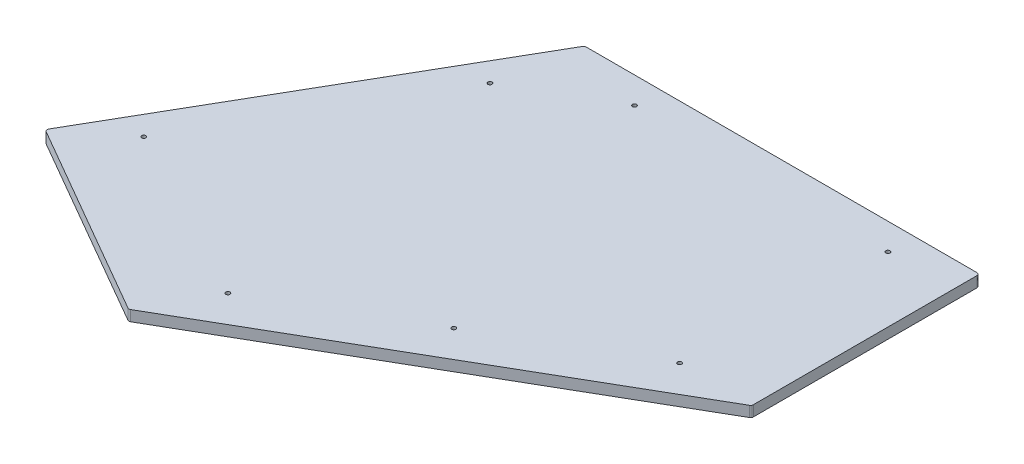
ISO-10303-21;
HEADER;
FILE_DESCRIPTION(('STEP AP214'),'2;1');
FILE_NAME('part.step','',(''),(''),'','','');
FILE_SCHEMA(('AUTOMOTIVE_DESIGN { 1 0 10303 214 1 1 1 1 }'));
ENDSEC;
DATA;
#1=APPLICATION_CONTEXT('core data for automotive mechanical design processes');
#2=APPLICATION_PROTOCOL_DEFINITION('international standard','automotive_design',2000,#1);
#3=PRODUCT_CONTEXT('',#1,'mechanical');
#4=PRODUCT('Part','Part','',(#3));
#5=PRODUCT_RELATED_PRODUCT_CATEGORY('part','',(#4));
#6=PRODUCT_DEFINITION_FORMATION('','',#4);
#7=PRODUCT_DEFINITION_CONTEXT('part definition',#1,'design');
#8=PRODUCT_DEFINITION('design','',#6,#7);
#9=PRODUCT_DEFINITION_SHAPE('','',#8);
#10=(LENGTH_UNIT() NAMED_UNIT(*) SI_UNIT(.MILLI.,.METRE.));
#11=(NAMED_UNIT(*) PLANE_ANGLE_UNIT() SI_UNIT($,.RADIAN.));
#12=(NAMED_UNIT(*) SI_UNIT($,.STERADIAN.) SOLID_ANGLE_UNIT());
#13=UNCERTAINTY_MEASURE_WITH_UNIT(LENGTH_MEASURE(1.E-05),#10,'distance_accuracy_value','');
#14=(GEOMETRIC_REPRESENTATION_CONTEXT(3) GLOBAL_UNCERTAINTY_ASSIGNED_CONTEXT((#13)) GLOBAL_UNIT_ASSIGNED_CONTEXT((#10,
#11,#12)) REPRESENTATION_CONTEXT('',''));
#15=CARTESIAN_POINT('',(0.,0.,0.));
#16=DIRECTION('',(0.,0.,1.));
#17=DIRECTION('',(1.,0.,0.));
#18=AXIS2_PLACEMENT_3D('',#15,#16,#17);
#19=CARTESIAN_POINT('',(0.,12.7,0.));
#20=DIRECTION('',(0.,1.,0.));
#21=DIRECTION('',(0.,0.,1.));
#22=AXIS2_PLACEMENT_3D('',#19,#20,#21);
#23=PLANE('',#22);
#24=CARTESIAN_POINT('',(213.713214706211,12.7,370.159699048508));
#25=DIRECTION('',(0.,1.,0.));
#26=DIRECTION('',(0.,0.,1.));
#27=AXIS2_PLACEMENT_3D('',#24,#25,#26);
#28=CIRCLE('',#27,2.45745000000002);
#29=CARTESIAN_POINT('',(213.713214706211,12.7,372.617149048508));
#30=VERTEX_POINT('',#29);
#31=EDGE_CURVE('E238',#30,#30,#28,.T.);
#32=ORIENTED_EDGE('',*,*,#31,.F.);
#33=EDGE_LOOP('',(#32));
#34=FACE_BOUND('',#33,.T.);
#35=CARTESIAN_POINT('',(394.287600704311,12.7,31.7496055682207));
#36=DIRECTION('',(0.,1.,0.));
#37=DIRECTION('',(0.,0.,1.));
#38=AXIS2_PLACEMENT_3D('',#35,#36,#37);
#39=CIRCLE('',#38,2.45744999999996);
#40=CARTESIAN_POINT('',(394.287600704311,12.7,34.2070555682207));
#41=VERTEX_POINT('',#40);
#42=EDGE_CURVE('E226',#41,#41,#39,.T.);
#43=ORIENTED_EDGE('',*,*,#42,.F.);
#44=EDGE_LOOP('',(#43));
#45=FACE_BOUND('',#44,.T.);
#46=CARTESIAN_POINT('',(-18.1641461086996,12.7,94.9617772273125));
#47=DIRECTION('',(0.,1.,0.));
#48=DIRECTION('',(0.,0.,1.));
#49=AXIS2_PLACEMENT_3D('',#46,#47,#48);
#50=CIRCLE('',#49,2.45744999999995);
#51=CARTESIAN_POINT('',(-18.1641461086996,12.7,97.4192272273125));
#52=VERTEX_POINT('',#51);
#53=EDGE_CURVE('E215',#52,#52,#50,.T.);
#54=ORIENTED_EDGE('',*,*,#53,.F.);
#55=EDGE_LOOP('',(#54));
#56=FACE_BOUND('',#55,.T.);
#57=DIRECTION('',(0.866023972491497,0.,-0.5000024790639));
#58=VECTOR('',#57,1.);
#59=CARTESIAN_POINT('',(-0.199185023168236,12.7,544.989420830469));
#60=LINE('',#59,#58);
#61=CARTESIAN_POINT('',(1.38831204742367,12.7,544.072872910301));
#62=VERTEX_POINT('',#61);
#63=CARTESIAN_POINT('',(470.487608575339,12.7,273.23647733536));
#64=VERTEX_POINT('',#63);
#65=EDGE_CURVE('E148',#62,#64,#60,.T.);
#66=ORIENTED_EDGE('',*,*,#65,.T.);
#67=CARTESIAN_POINT('',(468.900100704311,12.7,270.486851222699));
#68=DIRECTION('',(0.,1.,0.));
#69=DIRECTION('',(0.,0.,1.));
#70=AXIS2_PLACEMENT_3D('',#67,#68,#69);
#71=CIRCLE('',#70,3.175);
#72=CARTESIAN_POINT('',(472.075100704311,12.7,270.486851222699));
#73=VERTEX_POINT('',#72);
#74=EDGE_CURVE('E165',#64,#73,#71,.T.);
#75=ORIENTED_EDGE('',*,*,#74,.T.);
#76=DIRECTION('',(0.,0.,-1.));
#77=VECTOR('',#76,1.);
#78=CARTESIAN_POINT('',(472.075100704311,12.7,89.69375));
#79=LINE('',#78,#77);
#80=CARTESIAN_POINT('',(472.075100704311,12.7,3.175));
#81=VERTEX_POINT('',#80);
#82=EDGE_CURVE('E132',#73,#81,#79,.T.);
#83=ORIENTED_EDGE('',*,*,#82,.T.);
#84=CARTESIAN_POINT('',(468.900100704311,12.7,3.175));
#85=DIRECTION('',(0.,1.,0.));
#86=DIRECTION('',(0.,0.,1.));
#87=AXIS2_PLACEMENT_3D('',#84,#85,#86);
#88=CIRCLE('',#87,3.175);
#89=CARTESIAN_POINT('',(468.900100704311,12.7,0.));
#90=VERTEX_POINT('',#89);
#91=EDGE_CURVE('E159',#81,#90,#88,.T.);
#92=ORIENTED_EDGE('',*,*,#91,.T.);
#93=DIRECTION('',(-1.,0.,0.));
#94=VECTOR('',#93,1.);
#95=CARTESIAN_POINT('',(472.075100704311,12.7,0.));
#96=LINE('',#95,#94);
#97=CARTESIAN_POINT('',(1.83309351682742,12.7,0.));
#98=VERTEX_POINT('',#97);
#99=EDGE_CURVE('E142',#90,#98,#96,.T.);
#100=ORIENTED_EDGE('',*,*,#99,.T.);
#101=CARTESIAN_POINT('',(1.83309351682742,12.7,3.175));
#102=DIRECTION('',(0.,1.,0.));
#103=DIRECTION('',(0.,0.,1.));
#104=AXIS2_PLACEMENT_3D('',#101,#102,#103);
#105=CIRCLE('',#104,3.175);
#106=CARTESIAN_POINT('',(-0.916541949284118,12.7,1.58750832962766));
#107=VERTEX_POINT('',#106);
#108=EDGE_CURVE('E161',#98,#107,#105,.T.);
#109=ORIENTED_EDGE('',*,*,#108,.T.);
#110=DIRECTION('',(-0.499997376495225,0.,0.866026918460328));
#111=VECTOR('',#110,1.);
#112=CARTESIAN_POINT('',(0.,12.7,0.));
#113=LINE('',#112,#111);
#114=CARTESIAN_POINT('',(-234.448820190503,12.7,406.080109278692));
#115=VERTEX_POINT('',#114);
#116=EDGE_CURVE('E210',#107,#115,#113,.T.);
#117=ORIENTED_EDGE('',*,*,#116,.T.);
#118=CARTESIAN_POINT('',(-231.699184724391,12.7,407.667600949065));
#119=DIRECTION('',(0.,1.,0.));
#120=DIRECTION('',(0.,0.,1.));
#121=AXIS2_PLACEMENT_3D('',#118,#119,#120);
#122=CIRCLE('',#121,3.175);
#123=CARTESIAN_POINT('',(-233.286676394763,12.7,410.417236415176));
#124=VERTEX_POINT('',#123);
#125=EDGE_CURVE('E56',#115,#124,#122,.T.);
#126=ORIENTED_EDGE('',*,*,#125,.T.);
#127=DIRECTION('',(0.866026918460328,0.,0.499997376495225));
#128=VECTOR('',#127,1.);
#129=CARTESIAN_POINT('',(-236.036311860875,12.7,408.829744744804));
#130=LINE('',#129,#128);
#131=CARTESIAN_POINT('',(-1.78668749397667,12.7,544.072882263752));
#132=VERTEX_POINT('',#131);
#133=EDGE_CURVE('E207',#124,#132,#130,.T.);
#134=ORIENTED_EDGE('',*,*,#133,.T.);
#135=CARTESIAN_POINT('',(-0.199195823604249,12.7,541.323246797641));
#136=DIRECTION('',(0.,1.,0.));
#137=DIRECTION('',(0.,0.,1.));
#138=AXIS2_PLACEMENT_3D('',#135,#136,#137);
#139=CIRCLE('',#138,3.175);
#140=EDGE_CURVE('E163',#132,#62,#139,.T.);
#141=ORIENTED_EDGE('',*,*,#140,.T.);
#142=EDGE_LOOP('',(#66,#75,#83,#92,#100,#109,#117,#126,#134,#141));
#143=FACE_BOUND('',#142,.T.);
#144=CARTESIAN_POINT('',(-169.646411275637,12.7,357.338592528794));
#145=DIRECTION('',(0.,1.,0.));
#146=DIRECTION('',(0.,0.,1.));
#147=AXIS2_PLACEMENT_3D('',#144,#145,#146);
#148=CIRCLE('',#147,2.45744999999998);
#149=CARTESIAN_POINT('',(-169.646411275637,12.7,359.796042528794));
#150=VERTEX_POINT('',#149);
#151=EDGE_CURVE('E188',#150,#150,#148,.T.);
#152=ORIENTED_EDGE('',*,*,#151,.F.);
#153=EDGE_LOOP('',(#152));
#154=FACE_BOUND('',#153,.T.);
#155=CARTESIAN_POINT('',(91.3214807043114,12.7,31.7496055682207));
#156=DIRECTION('',(0.,1.,0.));
#157=DIRECTION('',(0.,0.,1.));
#158=AXIS2_PLACEMENT_3D('',#155,#156,#157);
#159=CIRCLE('',#158,2.45744999999997);
#160=CARTESIAN_POINT('',(91.3214807043114,12.7,34.2070555682207));
#161=VERTEX_POINT('',#160);
#162=EDGE_CURVE('E220',#161,#161,#159,.T.);
#163=ORIENTED_EDGE('',*,*,#162,.F.);
#164=EDGE_LOOP('',(#163));
#165=FACE_BOUND('',#164,.T.);
#166=CARTESIAN_POINT('',(384.876900704311,12.7,271.337645568221));
#167=DIRECTION('',(0.,1.,0.));
#168=DIRECTION('',(0.,0.,1.));
#169=AXIS2_PLACEMENT_3D('',#166,#167,#168);
#170=CIRCLE('',#169,2.45745000000002);
#171=CARTESIAN_POINT('',(384.876900704311,12.7,273.795095568221));
#172=VERTEX_POINT('',#171);
#173=EDGE_CURVE('E232',#172,#172,#170,.T.);
#174=ORIENTED_EDGE('',*,*,#173,.F.);
#175=EDGE_LOOP('',(#174));
#176=FACE_BOUND('',#175,.T.);
#177=CARTESIAN_POINT('',(42.5495287081099,12.7,468.981752528795));
#178=DIRECTION('',(0.,1.,0.));
#179=DIRECTION('',(0.,0.,1.));
#180=AXIS2_PLACEMENT_3D('',#177,#178,#179);
#181=CIRCLE('',#180,2.45745000000007);
#182=CARTESIAN_POINT('',(42.5495287081099,12.7,471.439202528795));
#183=VERTEX_POINT('',#182);
#184=EDGE_CURVE('E244',#183,#183,#181,.T.);
#185=ORIENTED_EDGE('',*,*,#184,.F.);
#186=EDGE_LOOP('',(#185));
#187=FACE_BOUND('',#186,.T.);
#188=ADVANCED_FACE('F34',(#34,#45,#56,#143,#154,#165,#176,#187),#23,.T.);
#189=CARTESIAN_POINT('',(0.,0.,0.));
#190=DIRECTION('',(0.,1.,0.));
#191=DIRECTION('',(0.,0.,1.));
#192=AXIS2_PLACEMENT_3D('',#189,#190,#191);
#193=PLANE('',#192);
#194=DIRECTION('',(0.,0.,-1.));
#195=VECTOR('',#194,1.);
#196=CARTESIAN_POINT('',(472.075100704311,0.,89.69375));
#197=LINE('',#196,#195);
#198=CARTESIAN_POINT('',(472.075100704311,0.,270.486851222699));
#199=VERTEX_POINT('',#198);
#200=CARTESIAN_POINT('',(472.075100704311,0.,3.17500000000003));
#201=VERTEX_POINT('',#200);
#202=EDGE_CURVE('E129',#199,#201,#197,.T.);
#203=ORIENTED_EDGE('',*,*,#202,.F.);
#204=CARTESIAN_POINT('',(468.900100704311,0.,270.486851222699));
#205=DIRECTION('',(0.,1.,0.));
#206=DIRECTION('',(0.,0.,1.));
#207=AXIS2_PLACEMENT_3D('',#204,#205,#206);
#208=CIRCLE('',#207,3.175);
#209=CARTESIAN_POINT('',(470.487608575339,0.,273.23647733536));
#210=VERTEX_POINT('',#209);
#211=EDGE_CURVE('E112',#199,#210,#208,.F.);
#212=ORIENTED_EDGE('',*,*,#211,.T.);
#213=DIRECTION('',(0.866023972491497,0.,-0.5000024790639));
#214=VECTOR('',#213,1.);
#215=CARTESIAN_POINT('',(-0.199185023168236,0.,544.989420830469));
#216=LINE('',#215,#214);
#217=CARTESIAN_POINT('',(1.38831204742367,0.,544.072872910301));
#218=VERTEX_POINT('',#217);
#219=EDGE_CURVE('E140',#218,#210,#216,.T.);
#220=ORIENTED_EDGE('',*,*,#219,.F.);
#221=CARTESIAN_POINT('',(-0.199195823604249,0.,541.323246797641));
#222=DIRECTION('',(0.,1.,0.));
#223=DIRECTION('',(0.,0.,1.));
#224=AXIS2_PLACEMENT_3D('',#221,#222,#223);
#225=CIRCLE('',#224,3.175);
#226=CARTESIAN_POINT('',(-1.78668749397663,0.,544.072882263752));
#227=VERTEX_POINT('',#226);
#228=EDGE_CURVE('E123',#218,#227,#225,.F.);
#229=ORIENTED_EDGE('',*,*,#228,.T.);
#230=DIRECTION('',(0.866026918460328,0.,0.499997376495225));
#231=VECTOR('',#230,1.);
#232=CARTESIAN_POINT('',(-71.0581838941823,0.,504.079244967144));
#233=LINE('',#232,#231);
#234=CARTESIAN_POINT('',(-233.286676394763,0.,410.417236415176));
#235=VERTEX_POINT('',#234);
#236=EDGE_CURVE('E144',#235,#227,#233,.T.);
#237=ORIENTED_EDGE('',*,*,#236,.F.);
#238=CARTESIAN_POINT('',(-231.699184724391,0.,407.667600949065));
#239=DIRECTION('',(0.,1.,0.));
#240=DIRECTION('',(0.,0.,1.));
#241=AXIS2_PLACEMENT_3D('',#238,#239,#240);
#242=CIRCLE('',#241,3.175);
#243=CARTESIAN_POINT('',(-234.448820190503,0.,406.080109278692));
#244=VERTEX_POINT('',#243);
#245=EDGE_CURVE('E133',#235,#244,#242,.F.);
#246=ORIENTED_EDGE('',*,*,#245,.T.);
#247=DIRECTION('',(-0.499997376495225,0.,0.866026918460328));
#248=VECTOR('',#247,1.);
#249=CARTESIAN_POINT('',(0.,0.,0.));
#250=LINE('',#249,#248);
#251=CARTESIAN_POINT('',(-0.916541949284118,0.,1.58750832962766));
#252=VERTEX_POINT('',#251);
#253=EDGE_CURVE('E187',#252,#244,#250,.T.);
#254=ORIENTED_EDGE('',*,*,#253,.F.);
#255=CARTESIAN_POINT('',(1.83309351682742,0.,3.175));
#256=DIRECTION('',(0.,1.,0.));
#257=DIRECTION('',(0.,0.,1.));
#258=AXIS2_PLACEMENT_3D('',#255,#256,#257);
#259=CIRCLE('',#258,3.175);
#260=CARTESIAN_POINT('',(1.83309351682742,0.,0.));
#261=VERTEX_POINT('',#260);
#262=EDGE_CURVE('E152',#252,#261,#259,.F.);
#263=ORIENTED_EDGE('',*,*,#262,.T.);
#264=DIRECTION('',(-1.,0.,0.));
#265=VECTOR('',#264,1.);
#266=CARTESIAN_POINT('',(472.075100704311,0.,0.));
#267=LINE('',#266,#265);
#268=CARTESIAN_POINT('',(468.900100704311,0.,0.));
#269=VERTEX_POINT('',#268);
#270=EDGE_CURVE('E181',#269,#261,#267,.T.);
#271=ORIENTED_EDGE('',*,*,#270,.F.);
#272=CARTESIAN_POINT('',(468.900100704311,0.,3.175));
#273=DIRECTION('',(0.,1.,0.));
#274=DIRECTION('',(0.,0.,1.));
#275=AXIS2_PLACEMENT_3D('',#272,#273,#274);
#276=CIRCLE('',#275,3.175);
#277=EDGE_CURVE('E139',#269,#201,#276,.F.);
#278=ORIENTED_EDGE('',*,*,#277,.T.);
#279=EDGE_LOOP('',(#203,#212,#220,#229,#237,#246,#254,#263,#271,#278));
#280=FACE_BOUND('',#279,.T.);
#281=CARTESIAN_POINT('',(-169.646411275637,0.,357.338592528794));
#282=DIRECTION('',(0.,1.,0.));
#283=DIRECTION('',(0.,0.,1.));
#284=AXIS2_PLACEMENT_3D('',#281,#282,#283);
#285=CIRCLE('',#284,2.45744999999998);
#286=CARTESIAN_POINT('',(-169.646411275637,0.,359.796042528794));
#287=VERTEX_POINT('',#286);
#288=EDGE_CURVE('E193',#287,#287,#285,.T.);
#289=ORIENTED_EDGE('',*,*,#288,.T.);
#290=EDGE_LOOP('',(#289));
#291=FACE_BOUND('',#290,.T.);
#292=CARTESIAN_POINT('',(-18.1641461086996,0.,94.9617772273125));
#293=DIRECTION('',(0.,1.,0.));
#294=DIRECTION('',(0.,0.,1.));
#295=AXIS2_PLACEMENT_3D('',#292,#293,#294);
#296=CIRCLE('',#295,2.45744999999995);
#297=CARTESIAN_POINT('',(-18.1641461086996,0.,97.4192272273125));
#298=VERTEX_POINT('',#297);
#299=EDGE_CURVE('E217',#298,#298,#296,.T.);
#300=ORIENTED_EDGE('',*,*,#299,.T.);
#301=EDGE_LOOP('',(#300));
#302=FACE_BOUND('',#301,.T.);
#303=CARTESIAN_POINT('',(91.3214807043114,0.,31.7496055682207));
#304=DIRECTION('',(0.,1.,0.));
#305=DIRECTION('',(0.,0.,1.));
#306=AXIS2_PLACEMENT_3D('',#303,#304,#305);
#307=CIRCLE('',#306,2.45744999999997);
#308=CARTESIAN_POINT('',(91.3214807043114,0.,34.2070555682207));
#309=VERTEX_POINT('',#308);
#310=EDGE_CURVE('E223',#309,#309,#307,.T.);
#311=ORIENTED_EDGE('',*,*,#310,.T.);
#312=EDGE_LOOP('',(#311));
#313=FACE_BOUND('',#312,.T.);
#314=CARTESIAN_POINT('',(394.287600704311,0.,31.7496055682207));
#315=DIRECTION('',(0.,1.,0.));
#316=DIRECTION('',(0.,0.,1.));
#317=AXIS2_PLACEMENT_3D('',#314,#315,#316);
#318=CIRCLE('',#317,2.45744999999996);
#319=CARTESIAN_POINT('',(394.287600704311,0.,34.2070555682207));
#320=VERTEX_POINT('',#319);
#321=EDGE_CURVE('E229',#320,#320,#318,.T.);
#322=ORIENTED_EDGE('',*,*,#321,.T.);
#323=EDGE_LOOP('',(#322));
#324=FACE_BOUND('',#323,.T.);
#325=CARTESIAN_POINT('',(384.876900704311,0.,271.337645568221));
#326=DIRECTION('',(0.,1.,0.));
#327=DIRECTION('',(0.,0.,1.));
#328=AXIS2_PLACEMENT_3D('',#325,#326,#327);
#329=CIRCLE('',#328,2.45745000000002);
#330=CARTESIAN_POINT('',(384.876900704311,0.,273.795095568221));
#331=VERTEX_POINT('',#330);
#332=EDGE_CURVE('E235',#331,#331,#329,.T.);
#333=ORIENTED_EDGE('',*,*,#332,.T.);
#334=EDGE_LOOP('',(#333));
#335=FACE_BOUND('',#334,.T.);
#336=CARTESIAN_POINT('',(213.713214706211,0.,370.159699048508));
#337=DIRECTION('',(0.,1.,0.));
#338=DIRECTION('',(0.,0.,1.));
#339=AXIS2_PLACEMENT_3D('',#336,#337,#338);
#340=CIRCLE('',#339,2.45745000000002);
#341=CARTESIAN_POINT('',(213.713214706211,0.,372.617149048508));
#342=VERTEX_POINT('',#341);
#343=EDGE_CURVE('E241',#342,#342,#340,.T.);
#344=ORIENTED_EDGE('',*,*,#343,.T.);
#345=EDGE_LOOP('',(#344));
#346=FACE_BOUND('',#345,.T.);
#347=CARTESIAN_POINT('',(42.5495287081099,0.,468.981752528795));
#348=DIRECTION('',(0.,1.,0.));
#349=DIRECTION('',(0.,0.,1.));
#350=AXIS2_PLACEMENT_3D('',#347,#348,#349);
#351=CIRCLE('',#350,2.45745000000007);
#352=CARTESIAN_POINT('',(42.5495287081099,0.,471.439202528795));
#353=VERTEX_POINT('',#352);
#354=EDGE_CURVE('E247',#353,#353,#351,.T.);
#355=ORIENTED_EDGE('',*,*,#354,.T.);
#356=EDGE_LOOP('',(#355));
#357=FACE_BOUND('',#356,.T.);
#358=ADVANCED_FACE('F136',(#280,#291,#302,#313,#324,#335,#346,#357),#193,.F.);
#359=CARTESIAN_POINT('',(472.075100704311,12.7,0.));
#360=DIRECTION('',(0.,0.,1.));
#361=DIRECTION('',(1.,0.,0.));
#362=AXIS2_PLACEMENT_3D('',#359,#360,#361);
#363=PLANE('',#362);
#364=ORIENTED_EDGE('',*,*,#270,.T.);
#365=DIRECTION('',(0.,-1.,0.));
#366=VECTOR('',#365,1.);
#367=CARTESIAN_POINT('',(1.83309351682742,12.7,0.));
#368=LINE('',#367,#366);
#369=EDGE_CURVE('E11',#261,#98,#368,.F.);
#370=ORIENTED_EDGE('',*,*,#369,.T.);
#371=ORIENTED_EDGE('',*,*,#99,.F.);
#372=DIRECTION('',(0.,-1.,0.));
#373=VECTOR('',#372,1.);
#374=CARTESIAN_POINT('',(468.900100704311,12.7,0.));
#375=LINE('',#374,#373);
#376=EDGE_CURVE('E42',#90,#269,#375,.T.);
#377=ORIENTED_EDGE('',*,*,#376,.T.);
#378=EDGE_LOOP('',(#364,#370,#371,#377));
#379=FACE_BOUND('',#378,.T.);
#380=ADVANCED_FACE('F180',(#379),#363,.F.);
#381=CARTESIAN_POINT('',(0.,12.7,0.));
#382=DIRECTION('',(0.866026918460328,0.,0.499997376495225));
#383=DIRECTION('',(0.499997376495225,0.,-0.866026918460328));
#384=AXIS2_PLACEMENT_3D('',#381,#382,#383);
#385=PLANE('',#384);
#386=ORIENTED_EDGE('',*,*,#116,.F.);
#387=DIRECTION('',(0.,-1.,0.));
#388=VECTOR('',#387,1.);
#389=CARTESIAN_POINT('',(-0.916541949284118,12.7,1.58750832962766));
#390=LINE('',#389,#388);
#391=EDGE_CURVE('E173',#107,#252,#390,.T.);
#392=ORIENTED_EDGE('',*,*,#391,.T.);
#393=ORIENTED_EDGE('',*,*,#253,.T.);
#394=DIRECTION('',(0.,-1.,0.));
#395=VECTOR('',#394,1.);
#396=CARTESIAN_POINT('',(-234.448820190503,12.7,406.080109278692));
#397=LINE('',#396,#395);
#398=EDGE_CURVE('E171',#244,#115,#397,.F.);
#399=ORIENTED_EDGE('',*,*,#398,.T.);
#400=EDGE_LOOP('',(#386,#392,#393,#399));
#401=FACE_BOUND('',#400,.T.);
#402=ADVANCED_FACE('F275',(#401),#385,.F.);
#403=CARTESIAN_POINT('',(-71.0581838941823,12.7,504.079244967144));
#404=DIRECTION('',(0.499997376495225,0.,-0.866026918460328));
#405=DIRECTION('',(-0.866026918460328,0.,-0.499997376495225));
#406=AXIS2_PLACEMENT_3D('',#403,#404,#405);
#407=PLANE('',#406);
#408=ORIENTED_EDGE('',*,*,#236,.T.);
#409=DIRECTION('',(0.,-1.,0.));
#410=VECTOR('',#409,1.);
#411=CARTESIAN_POINT('',(-1.7866874939766,12.7,544.072882263752));
#412=LINE('',#411,#410);
#413=EDGE_CURVE('E49',#227,#132,#412,.F.);
#414=ORIENTED_EDGE('',*,*,#413,.T.);
#415=ORIENTED_EDGE('',*,*,#133,.F.);
#416=DIRECTION('',(0.,-1.,0.));
#417=VECTOR('',#416,1.);
#418=CARTESIAN_POINT('',(-233.286676394763,12.7,410.417236415176));
#419=LINE('',#418,#417);
#420=EDGE_CURVE('E167',#124,#235,#419,.T.);
#421=ORIENTED_EDGE('',*,*,#420,.T.);
#422=EDGE_LOOP('',(#408,#414,#415,#421));
#423=FACE_BOUND('',#422,.T.);
#424=ADVANCED_FACE('F198',(#423),#407,.F.);
#425=CARTESIAN_POINT('',(-0.199185023168236,12.7,544.989420830469));
#426=DIRECTION('',(-0.5000024790639,0.,-0.866023972491497));
#427=DIRECTION('',(-0.866023972491498,0.,0.5000024790639));
#428=AXIS2_PLACEMENT_3D('',#425,#426,#427);
#429=PLANE('',#428);
#430=ORIENTED_EDGE('',*,*,#219,.T.);
#431=DIRECTION('',(0.,-1.,0.));
#432=VECTOR('',#431,1.);
#433=CARTESIAN_POINT('',(470.487608575339,12.7,273.23647733536));
#434=LINE('',#433,#432);
#435=EDGE_CURVE('E117',#210,#64,#434,.F.);
#436=ORIENTED_EDGE('',*,*,#435,.T.);
#437=ORIENTED_EDGE('',*,*,#65,.F.);
#438=DIRECTION('',(0.,-1.,0.));
#439=VECTOR('',#438,1.);
#440=CARTESIAN_POINT('',(1.38831204742366,12.7,544.072872910301));
#441=LINE('',#440,#439);
#442=EDGE_CURVE('E122',#62,#218,#441,.T.);
#443=ORIENTED_EDGE('',*,*,#442,.T.);
#444=EDGE_LOOP('',(#430,#436,#437,#443));
#445=FACE_BOUND('',#444,.T.);
#446=ADVANCED_FACE('F209',(#445),#429,.F.);
#447=CARTESIAN_POINT('',(472.075100704311,12.7,89.69375));
#448=DIRECTION('',(-1.,0.,0.));
#449=DIRECTION('',(0.,0.,1.));
#450=AXIS2_PLACEMENT_3D('',#447,#448,#449);
#451=PLANE('',#450);
#452=ORIENTED_EDGE('',*,*,#82,.F.);
#453=DIRECTION('',(0.,-1.,0.));
#454=VECTOR('',#453,1.);
#455=CARTESIAN_POINT('',(472.075100704311,12.7,270.486851222699));
#456=LINE('',#455,#454);
#457=EDGE_CURVE('E116',#73,#199,#456,.T.);
#458=ORIENTED_EDGE('',*,*,#457,.T.);
#459=ORIENTED_EDGE('',*,*,#202,.T.);
#460=DIRECTION('',(0.,-1.,0.));
#461=VECTOR('',#460,1.);
#462=CARTESIAN_POINT('',(472.075100704311,12.7,3.175));
#463=LINE('',#462,#461);
#464=EDGE_CURVE('E134',#201,#81,#463,.F.);
#465=ORIENTED_EDGE('',*,*,#464,.T.);
#466=EDGE_LOOP('',(#452,#458,#459,#465));
#467=FACE_BOUND('',#466,.T.);
#468=ADVANCED_FACE('F128',(#467),#451,.F.);
#469=CARTESIAN_POINT('',(-169.646411275637,12.7,357.338592528794));
#470=DIRECTION('',(0.,-1.,0.));
#471=DIRECTION('',(0.,0.,-1.));
#472=AXIS2_PLACEMENT_3D('',#469,#470,#471);
#473=CYLINDRICAL_SURFACE('',#472,2.45744999999998);
#474=ORIENTED_EDGE('',*,*,#151,.T.);
#475=EDGE_LOOP('',(#474));
#476=FACE_BOUND('',#475,.T.);
#477=ORIENTED_EDGE('',*,*,#288,.F.);
#478=EDGE_LOOP('',(#477));
#479=FACE_BOUND('',#478,.T.);
#480=ADVANCED_FACE('F266',(#476,#479),#473,.F.);
#481=CARTESIAN_POINT('',(-18.1641461086996,12.7,94.9617772273125));
#482=DIRECTION('',(0.,-1.,0.));
#483=DIRECTION('',(0.,0.,-1.));
#484=AXIS2_PLACEMENT_3D('',#481,#482,#483);
#485=CYLINDRICAL_SURFACE('',#484,2.45744999999995);
#486=ORIENTED_EDGE('',*,*,#53,.T.);
#487=EDGE_LOOP('',(#486));
#488=FACE_BOUND('',#487,.T.);
#489=ORIENTED_EDGE('',*,*,#299,.F.);
#490=EDGE_LOOP('',(#489));
#491=FACE_BOUND('',#490,.T.);
#492=ADVANCED_FACE('F416',(#488,#491),#485,.F.);
#493=CARTESIAN_POINT('',(91.3214807043114,12.7,31.7496055682207));
#494=DIRECTION('',(0.,-1.,0.));
#495=DIRECTION('',(0.,0.,-1.));
#496=AXIS2_PLACEMENT_3D('',#493,#494,#495);
#497=CYLINDRICAL_SURFACE('',#496,2.45744999999997);
#498=ORIENTED_EDGE('',*,*,#162,.T.);
#499=EDGE_LOOP('',(#498));
#500=FACE_BOUND('',#499,.T.);
#501=ORIENTED_EDGE('',*,*,#310,.F.);
#502=EDGE_LOOP('',(#501));
#503=FACE_BOUND('',#502,.T.);
#504=ADVANCED_FACE('F406',(#500,#503),#497,.F.);
#505=CARTESIAN_POINT('',(394.287600704311,12.7,31.7496055682207));
#506=DIRECTION('',(0.,-1.,0.));
#507=DIRECTION('',(0.,0.,-1.));
#508=AXIS2_PLACEMENT_3D('',#505,#506,#507);
#509=CYLINDRICAL_SURFACE('',#508,2.45744999999996);
#510=ORIENTED_EDGE('',*,*,#42,.T.);
#511=EDGE_LOOP('',(#510));
#512=FACE_BOUND('',#511,.T.);
#513=ORIENTED_EDGE('',*,*,#321,.F.);
#514=EDGE_LOOP('',(#513));
#515=FACE_BOUND('',#514,.T.);
#516=ADVANCED_FACE('F396',(#512,#515),#509,.F.);
#517=CARTESIAN_POINT('',(384.876900704311,12.7,271.337645568221));
#518=DIRECTION('',(0.,-1.,0.));
#519=DIRECTION('',(0.,0.,-1.));
#520=AXIS2_PLACEMENT_3D('',#517,#518,#519);
#521=CYLINDRICAL_SURFACE('',#520,2.45745000000002);
#522=ORIENTED_EDGE('',*,*,#173,.T.);
#523=EDGE_LOOP('',(#522));
#524=FACE_BOUND('',#523,.T.);
#525=ORIENTED_EDGE('',*,*,#332,.F.);
#526=EDGE_LOOP('',(#525));
#527=FACE_BOUND('',#526,.T.);
#528=ADVANCED_FACE('F386',(#524,#527),#521,.F.);
#529=CARTESIAN_POINT('',(213.713214706211,12.7,370.159699048508));
#530=DIRECTION('',(0.,-1.,0.));
#531=DIRECTION('',(0.,0.,-1.));
#532=AXIS2_PLACEMENT_3D('',#529,#530,#531);
#533=CYLINDRICAL_SURFACE('',#532,2.45745000000002);
#534=ORIENTED_EDGE('',*,*,#31,.T.);
#535=EDGE_LOOP('',(#534));
#536=FACE_BOUND('',#535,.T.);
#537=ORIENTED_EDGE('',*,*,#343,.F.);
#538=EDGE_LOOP('',(#537));
#539=FACE_BOUND('',#538,.T.);
#540=ADVANCED_FACE('F377',(#536,#539),#533,.F.);
#541=CARTESIAN_POINT('',(42.5495287081099,12.7,468.981752528795));
#542=DIRECTION('',(0.,-1.,0.));
#543=DIRECTION('',(0.,0.,-1.));
#544=AXIS2_PLACEMENT_3D('',#541,#542,#543);
#545=CYLINDRICAL_SURFACE('',#544,2.45745000000007);
#546=ORIENTED_EDGE('',*,*,#184,.T.);
#547=EDGE_LOOP('',(#546));
#548=FACE_BOUND('',#547,.T.);
#549=ORIENTED_EDGE('',*,*,#354,.F.);
#550=EDGE_LOOP('',(#549));
#551=FACE_BOUND('',#550,.T.);
#552=ADVANCED_FACE('F253',(#548,#551),#545,.F.);
#553=CARTESIAN_POINT('',(468.900100704311,12.7,270.486851222699));
#554=DIRECTION('',(0.,-1.,0.));
#555=DIRECTION('',(0.,0.,-1.));
#556=AXIS2_PLACEMENT_3D('',#553,#554,#555);
#557=CYLINDRICAL_SURFACE('',#556,3.175);
#558=ORIENTED_EDGE('',*,*,#74,.F.);
#559=ORIENTED_EDGE('',*,*,#435,.F.);
#560=ORIENTED_EDGE('',*,*,#211,.F.);
#561=ORIENTED_EDGE('',*,*,#457,.F.);
#562=EDGE_LOOP('',(#558,#559,#560,#561));
#563=FACE_BOUND('',#562,.T.);
#564=ADVANCED_FACE('F115',(#563),#557,.T.);
#565=CARTESIAN_POINT('',(-0.199195823604249,12.7,541.323246797641));
#566=DIRECTION('',(0.,-1.,0.));
#567=DIRECTION('',(0.,0.,-1.));
#568=AXIS2_PLACEMENT_3D('',#565,#566,#567);
#569=CYLINDRICAL_SURFACE('',#568,3.175);
#570=ORIENTED_EDGE('',*,*,#140,.F.);
#571=ORIENTED_EDGE('',*,*,#413,.F.);
#572=ORIENTED_EDGE('',*,*,#228,.F.);
#573=ORIENTED_EDGE('',*,*,#442,.F.);
#574=EDGE_LOOP('',(#570,#571,#572,#573));
#575=FACE_BOUND('',#574,.T.);
#576=ADVANCED_FACE('F202',(#575),#569,.T.);
#577=CARTESIAN_POINT('',(1.83309351682742,12.7,3.175));
#578=DIRECTION('',(0.,-1.,0.));
#579=DIRECTION('',(0.,0.,-1.));
#580=AXIS2_PLACEMENT_3D('',#577,#578,#579);
#581=CYLINDRICAL_SURFACE('',#580,3.175);
#582=ORIENTED_EDGE('',*,*,#108,.F.);
#583=ORIENTED_EDGE('',*,*,#369,.F.);
#584=ORIENTED_EDGE('',*,*,#262,.F.);
#585=ORIENTED_EDGE('',*,*,#391,.F.);
#586=EDGE_LOOP('',(#582,#583,#584,#585));
#587=FACE_BOUND('',#586,.T.);
#588=ADVANCED_FACE('F285',(#587),#581,.T.);
#589=CARTESIAN_POINT('',(468.900100704311,12.7,3.175));
#590=DIRECTION('',(0.,-1.,0.));
#591=DIRECTION('',(0.,0.,-1.));
#592=AXIS2_PLACEMENT_3D('',#589,#590,#591);
#593=CYLINDRICAL_SURFACE('',#592,3.175);
#594=ORIENTED_EDGE('',*,*,#91,.F.);
#595=ORIENTED_EDGE('',*,*,#464,.F.);
#596=ORIENTED_EDGE('',*,*,#277,.F.);
#597=ORIENTED_EDGE('',*,*,#376,.F.);
#598=EDGE_LOOP('',(#594,#595,#596,#597));
#599=FACE_BOUND('',#598,.T.);
#600=ADVANCED_FACE('F287',(#599),#593,.T.);
#601=CARTESIAN_POINT('',(-231.699184724391,12.7,407.667600949065));
#602=DIRECTION('',(0.,-1.,0.));
#603=DIRECTION('',(0.,0.,-1.));
#604=AXIS2_PLACEMENT_3D('',#601,#602,#603);
#605=CYLINDRICAL_SURFACE('',#604,3.175);
#606=ORIENTED_EDGE('',*,*,#125,.F.);
#607=ORIENTED_EDGE('',*,*,#398,.F.);
#608=ORIENTED_EDGE('',*,*,#245,.F.);
#609=ORIENTED_EDGE('',*,*,#420,.F.);
#610=EDGE_LOOP('',(#606,#607,#608,#609));
#611=FACE_BOUND('',#610,.T.);
#612=ADVANCED_FACE('F36',(#611),#605,.T.);
#613=CLOSED_SHELL('',(#188,#358,#380,#402,#424,#446,#468,#480,#492,#504,#516,#528,#540,#552,
#564,#576,#588,#600,#612));
#614=MANIFOLD_SOLID_BREP('B2',#613);
#615=ADVANCED_BREP_SHAPE_REPRESENTATION('',(#18,#614),#14);
#616=SHAPE_DEFINITION_REPRESENTATION(#9,#615);
ENDSEC;
END-ISO-10303-21;
